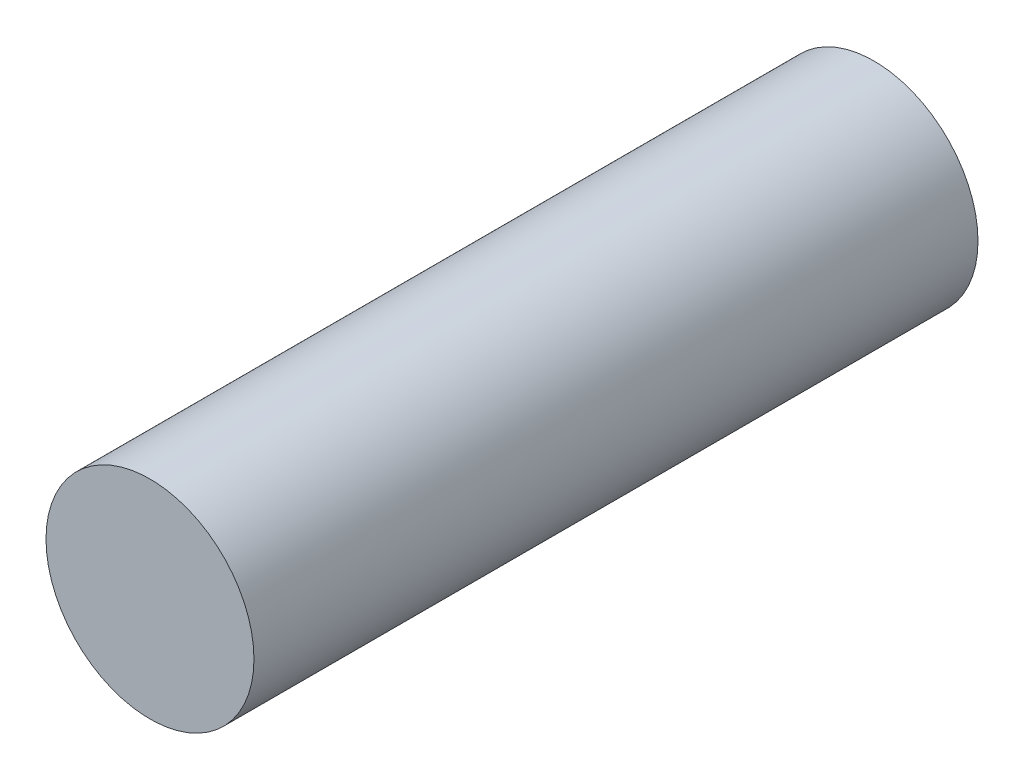
ISO-10303-21;
HEADER;
FILE_DESCRIPTION(('STEP AP214'),'2;1');
FILE_NAME('part.step','',(''),(''),'','','');
FILE_SCHEMA(('AUTOMOTIVE_DESIGN { 1 0 10303 214 1 1 1 1 }'));
ENDSEC;
DATA;
#1=APPLICATION_CONTEXT('core data for automotive mechanical design processes');
#2=APPLICATION_PROTOCOL_DEFINITION('international standard','automotive_design',2000,#1);
#3=PRODUCT_CONTEXT('',#1,'mechanical');
#4=PRODUCT('Part','Part','',(#3));
#5=PRODUCT_RELATED_PRODUCT_CATEGORY('part','',(#4));
#6=PRODUCT_DEFINITION_FORMATION('','',#4);
#7=PRODUCT_DEFINITION_CONTEXT('part definition',#1,'design');
#8=PRODUCT_DEFINITION('design','',#6,#7);
#9=PRODUCT_DEFINITION_SHAPE('','',#8);
#10=(LENGTH_UNIT() NAMED_UNIT(*) SI_UNIT(.MILLI.,.METRE.));
#11=(NAMED_UNIT(*) PLANE_ANGLE_UNIT() SI_UNIT($,.RADIAN.));
#12=(NAMED_UNIT(*) SI_UNIT($,.STERADIAN.) SOLID_ANGLE_UNIT());
#13=UNCERTAINTY_MEASURE_WITH_UNIT(LENGTH_MEASURE(1.E-05),#10,'distance_accuracy_value','');
#14=(GEOMETRIC_REPRESENTATION_CONTEXT(3) GLOBAL_UNCERTAINTY_ASSIGNED_CONTEXT((#13)) GLOBAL_UNIT_ASSIGNED_CONTEXT((#10,
#11,#12)) REPRESENTATION_CONTEXT('',''));
#15=CARTESIAN_POINT('',(0.,0.,0.));
#16=DIRECTION('',(0.,0.,1.));
#17=DIRECTION('',(1.,0.,0.));
#18=AXIS2_PLACEMENT_3D('',#15,#16,#17);
#19=CARTESIAN_POINT('',(0.,0.,25.2476));
#20=DIRECTION('',(0.,0.,-1.));
#21=DIRECTION('',(-1.,0.,0.));
#22=AXIS2_PLACEMENT_3D('',#19,#20,#21);
#23=CYLINDRICAL_SURFACE('',#22,7.2517);
#24=CARTESIAN_POINT('',(0.,0.,25.2476));
#25=DIRECTION('',(0.,0.,1.));
#26=DIRECTION('',(1.,0.,0.));
#27=AXIS2_PLACEMENT_3D('',#24,#25,#26);
#28=CIRCLE('',#27,7.2517);
#29=CARTESIAN_POINT('',(7.2517,0.,25.2476));
#30=VERTEX_POINT('',#29);
#31=EDGE_CURVE('E10',#30,#30,#28,.T.);
#32=ORIENTED_EDGE('',*,*,#31,.F.);
#33=EDGE_LOOP('',(#32));
#34=FACE_BOUND('',#33,.T.);
#35=CARTESIAN_POINT('',(0.,0.,-25.2476));
#36=DIRECTION('',(0.,0.,1.));
#37=DIRECTION('',(1.,0.,0.));
#38=AXIS2_PLACEMENT_3D('',#35,#36,#37);
#39=CIRCLE('',#38,7.2517);
#40=CARTESIAN_POINT('',(7.2517,0.,-25.2476));
#41=VERTEX_POINT('',#40);
#42=EDGE_CURVE('E34',#41,#41,#39,.T.);
#43=ORIENTED_EDGE('',*,*,#42,.T.);
#44=EDGE_LOOP('',(#43));
#45=FACE_BOUND('',#44,.T.);
#46=ADVANCED_FACE('F31',(#34,#45),#23,.T.);
#47=CARTESIAN_POINT('',(0.,0.,25.2476));
#48=DIRECTION('',(0.,0.,1.));
#49=DIRECTION('',(1.,0.,0.));
#50=AXIS2_PLACEMENT_3D('',#47,#48,#49);
#51=PLANE('',#50);
#52=ORIENTED_EDGE('',*,*,#31,.T.);
#53=EDGE_LOOP('',(#52));
#54=FACE_BOUND('',#53,.T.);
#55=ADVANCED_FACE('F46',(#54),#51,.T.);
#56=CARTESIAN_POINT('',(0.,0.,-25.2476));
#57=DIRECTION('',(0.,0.,1.));
#58=DIRECTION('',(1.,0.,0.));
#59=AXIS2_PLACEMENT_3D('',#56,#57,#58);
#60=PLANE('',#59);
#61=ORIENTED_EDGE('',*,*,#42,.F.);
#62=EDGE_LOOP('',(#61));
#63=FACE_BOUND('',#62,.T.);
#64=ADVANCED_FACE('F44',(#63),#60,.F.);
#65=CLOSED_SHELL('',(#46,#55,#64));
#66=MANIFOLD_SOLID_BREP('B2',#65);
#67=ADVANCED_BREP_SHAPE_REPRESENTATION('',(#18,#66),#14);
#68=SHAPE_DEFINITION_REPRESENTATION(#9,#67);
ENDSEC;
END-ISO-10303-21;
